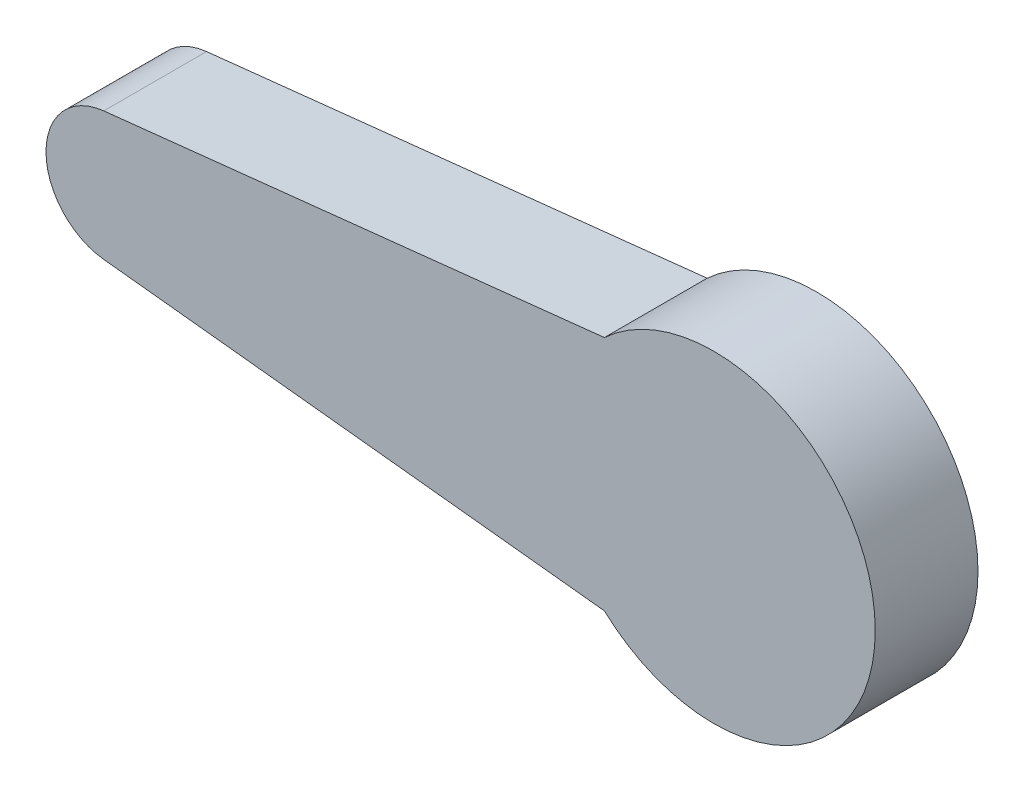
ISO-10303-21;
HEADER;
FILE_DESCRIPTION(('STEP AP214'),'2;1');
FILE_NAME('part.step','',(''),(''),'','','');
FILE_SCHEMA(('AUTOMOTIVE_DESIGN { 1 0 10303 214 1 1 1 1 }'));
ENDSEC;
DATA;
#1=APPLICATION_CONTEXT('core data for automotive mechanical design processes');
#2=APPLICATION_PROTOCOL_DEFINITION('international standard','automotive_design',2000,#1);
#3=PRODUCT_CONTEXT('',#1,'mechanical');
#4=PRODUCT('Part','Part','',(#3));
#5=PRODUCT_RELATED_PRODUCT_CATEGORY('part','',(#4));
#6=PRODUCT_DEFINITION_FORMATION('','',#4);
#7=PRODUCT_DEFINITION_CONTEXT('part definition',#1,'design');
#8=PRODUCT_DEFINITION('design','',#6,#7);
#9=PRODUCT_DEFINITION_SHAPE('','',#8);
#10=(LENGTH_UNIT() NAMED_UNIT(*) SI_UNIT(.MILLI.,.METRE.));
#11=(NAMED_UNIT(*) PLANE_ANGLE_UNIT() SI_UNIT($,.RADIAN.));
#12=(NAMED_UNIT(*) SI_UNIT($,.STERADIAN.) SOLID_ANGLE_UNIT());
#13=UNCERTAINTY_MEASURE_WITH_UNIT(LENGTH_MEASURE(1.E-05),#10,'distance_accuracy_value','');
#14=(GEOMETRIC_REPRESENTATION_CONTEXT(3) GLOBAL_UNCERTAINTY_ASSIGNED_CONTEXT((#13)) GLOBAL_UNIT_ASSIGNED_CONTEXT((#10,
#11,#12)) REPRESENTATION_CONTEXT('',''));
#15=CARTESIAN_POINT('',(0.,0.,0.));
#16=DIRECTION('',(0.,0.,1.));
#17=DIRECTION('',(1.,0.,0.));
#18=AXIS2_PLACEMENT_3D('',#15,#16,#17);
#19=CARTESIAN_POINT('',(-11.2799246231682,0.,0.));
#20=DIRECTION('',(0.,0.,1.));
#21=DIRECTION('',(1.,0.,0.));
#22=AXIS2_PLACEMENT_3D('',#19,#20,#21);
#23=PLANE('',#22);
#24=DIRECTION('',(-0.994225438983225,-0.10731158594771,0.));
#25=VECTOR('',#24,1.);
#26=CARTESIAN_POINT('',(7.93694518506527,4.60750982165337,0.));
#27=LINE('',#26,#25);
#28=CARTESIAN_POINT('',(7.93694518506527,4.60750982165337,0.));
#29=VERTEX_POINT('',#28);
#30=CARTESIAN_POINT('',(-11.5502114628193,2.50416625036577,0.));
#31=VERTEX_POINT('',#30);
#32=EDGE_CURVE('E133',#29,#31,#27,.T.);
#33=ORIENTED_EDGE('',*,*,#32,.F.);
#34=CARTESIAN_POINT('',(12.2013646778512,0.,0.));
#35=DIRECTION('',(0.,0.,-1.));
#36=DIRECTION('',(-1.,0.,0.));
#37=AXIS2_PLACEMENT_3D('',#34,#35,#36);
#38=CIRCLE('',#37,6.2780905032569);
#39=CARTESIAN_POINT('',(7.93694518506527,-4.60750982165337,0.));
#40=VERTEX_POINT('',#39);
#41=EDGE_CURVE('E144',#29,#40,#38,.T.);
#42=ORIENTED_EDGE('',*,*,#41,.T.);
#43=DIRECTION('',(0.994225438983225,-0.10731158594771,0.));
#44=VECTOR('',#43,1.);
#45=CARTESIAN_POINT('',(-11.5502114628193,-2.50416625036577,0.));
#46=LINE('',#45,#44);
#47=CARTESIAN_POINT('',(-11.5502114628193,-2.50416625036577,0.));
#48=VERTEX_POINT('',#47);
#49=EDGE_CURVE('E151',#48,#40,#46,.T.);
#50=ORIENTED_EDGE('',*,*,#49,.F.);
#51=CARTESIAN_POINT('',(-11.2799246231682,0.,0.));
#52=DIRECTION('',(0.,0.,1.));
#53=DIRECTION('',(1.,0.,0.));
#54=AXIS2_PLACEMENT_3D('',#51,#52,#53);
#55=CIRCLE('',#54,2.51871069898064);
#56=EDGE_CURVE('E136',#31,#48,#55,.T.);
#57=ORIENTED_EDGE('',*,*,#56,.F.);
#58=EDGE_LOOP('',(#33,#42,#50,#57));
#59=FACE_BOUND('',#58,.T.);
#60=CARTESIAN_POINT('',(-2.30825995095074,2.49806605279446,0.));
#61=CARTESIAN_POINT('',(-2.73027096534099,2.49868152297986,0.));
#62=CARTESIAN_POINT('',(-3.36525519111259,2.31776714159565,0.));
#63=CARTESIAN_POINT('',(-4.0519471173828,1.79121945249872,0.));
#64=CARTESIAN_POINT('',(-4.45450445000801,1.26652861552728,0.));
#65=CARTESIAN_POINT('',(-4.70755649296628,0.655614107295277,0.));
#66=CARTESIAN_POINT('',(-4.79387213088173,0.,0.));
#67=CARTESIAN_POINT('',(-4.70755649296628,-0.655614107295276,0.));
#68=CARTESIAN_POINT('',(-4.45450445000801,-1.26652861552729,0.));
#69=CARTESIAN_POINT('',(-4.0519471173828,-1.79121945249872,0.));
#70=CARTESIAN_POINT('',(-3.36525519111259,-2.31776714159565,0.));
#71=CARTESIAN_POINT('',(-2.73027096534099,-2.49868152297986,0.));
#72=CARTESIAN_POINT('',(-2.30825995095074,-2.49806605279446,0.));
#73=B_SPLINE_CURVE_WITH_KNOTS('',3,(#60,#61,#62,#63,#64,#65,#66,#67,#68,#69,#70,#71,#72),
.UNSPECIFIED.,.F.,.F.,(4,1,1,1,1,1,1,1,1,1,4),(0.,0.162547315698738,0.246910500112196,
0.331273484688599,0.415637005846892,0.5,0.584362994153108,0.668726515311401,0.753089499887804,
0.837452684301262,1.),.UNSPECIFIED.);
#74=CARTESIAN_POINT('',(-2.30825995095074,2.49806605279446,0.));
#75=VERTEX_POINT('',#74);
#76=CARTESIAN_POINT('',(-2.30825995095074,-2.49806605279446,0.));
#77=VERTEX_POINT('',#76);
#78=EDGE_CURVE('E55',#75,#77,#73,.T.);
#79=ORIENTED_EDGE('',*,*,#78,.T.);
#80=DIRECTION('',(0.998250566900798,-0.0591253387494285,0.));
#81=VECTOR('',#80,1.);
#82=CARTESIAN_POINT('',(9.37504414469004,-3.19005595520139,0.));
#83=LINE('',#82,#81);
#84=CARTESIAN_POINT('',(9.37504414469004,-3.19005595520139,0.));
#85=VERTEX_POINT('',#84);
#86=EDGE_CURVE('E132',#77,#85,#83,.T.);
#87=ORIENTED_EDGE('',*,*,#86,.T.);
#88=CARTESIAN_POINT('',(9.37504414469004,-3.19005595520139,0.));
#89=CARTESIAN_POINT('',(9.74360040876109,-3.53484293919703,0.));
#90=CARTESIAN_POINT('',(10.5428570191187,-3.88633535555283,0.));
#91=CARTESIAN_POINT('',(11.7382013204245,-4.05165126945385,0.));
#92=CARTESIAN_POINT('',(12.7877855246039,-3.91194774983133,0.));
#93=CARTESIAN_POINT('',(13.7642990955492,-3.50777948619926,0.));
#94=CARTESIAN_POINT('',(14.6032502640424,-2.86396771618949,0.));
#95=CARTESIAN_POINT('',(15.2468503589831,-2.02521728614815,0.));
#96=CARTESIAN_POINT('',(15.6516651084562,-1.04811231295659,0.));
#97=CARTESIAN_POINT('',(15.7889928154445,-0.000691817754812136,0.));
#98=CARTESIAN_POINT('',(15.6535287568039,1.05087958765089,0.));
#99=CARTESIAN_POINT('',(15.2393957517555,2.01553180953456,0.));
#100=CARTESIAN_POINT('',(14.749448402042,2.72799658708562,0.));
#101=CARTESIAN_POINT('',(14.1725249859326,3.12361030474993,0.));
#102=CARTESIAN_POINT('',(13.6476475877295,3.58835164958077,0.));
#103=CARTESIAN_POINT('',(12.7816062725977,3.90400354803467,0.));
#104=CARTESIAN_POINT('',(11.739855888239,4.05377842345117,0.));
#105=CARTESIAN_POINT('',(10.54211336446,3.88537929441961,0.));
#106=CARTESIAN_POINT('',(9.74376271711854,3.53505160690367,0.));
#107=CARTESIAN_POINT('',(9.37504414469004,3.19005595520139,0.));
#108=B_SPLINE_CURVE_WITH_KNOTS('',3,(#88,#89,#90,#91,#92,#93,#94,#95,#96,#97,#98,#99,#100,#101,
#102,#103,#104,#105,#106,#107),.UNSPECIFIED.,.F.,.F.,(4,1,1,1,1,1,1,1,1,1,1,1,1,1,1,1,1,4),(0.,
0.0851368769983083,0.144403022869954,0.2036691687416,0.262935433986645,0.32220149870547,
0.381467600441595,0.440733878928586,0.499999999999802,0.559266121071018,0.618532399558009,
0.677798501294134,0.702497282971547,0.737064566013355,0.7963308312584,0.855596977130046,
0.914863123001692,1.),.UNSPECIFIED.);
#109=CARTESIAN_POINT('',(9.37504414469004,3.19005595520139,0.));
#110=VERTEX_POINT('',#109);
#111=EDGE_CURVE('E304',#85,#110,#108,.T.);
#112=ORIENTED_EDGE('',*,*,#111,.T.);
#113=DIRECTION('',(-0.998250566900798,-0.0591253387494285,0.));
#114=VECTOR('',#113,1.);
#115=CARTESIAN_POINT('',(-2.30825995095074,2.49806605279446,0.));
#116=LINE('',#115,#114);
#117=EDGE_CURVE('E128',#110,#75,#116,.T.);
#118=ORIENTED_EDGE('',*,*,#117,.T.);
#119=EDGE_LOOP('',(#79,#87,#112,#118));
#120=FACE_BOUND('',#119,.T.);
#121=ADVANCED_FACE('F40',(#59,#120),#23,.F.);
#122=CARTESIAN_POINT('',(7.93694518506527,4.60750982165337,4.));
#123=DIRECTION('',(0.10731158594771,-0.994225438983225,0.));
#124=DIRECTION('',(0.994225438983225,0.10731158594771,0.));
#125=AXIS2_PLACEMENT_3D('',#122,#123,#124);
#126=PLANE('',#125);
#127=ORIENTED_EDGE('',*,*,#32,.T.);
#128=DIRECTION('',(0.,0.,-1.));
#129=VECTOR('',#128,1.);
#130=CARTESIAN_POINT('',(-11.5502114628193,2.50416625036577,4.));
#131=LINE('',#130,#129);
#132=CARTESIAN_POINT('',(-11.5502114628193,2.50416625036577,4.));
#133=VERTEX_POINT('',#132);
#134=EDGE_CURVE('E11',#133,#31,#131,.T.);
#135=ORIENTED_EDGE('',*,*,#134,.F.);
#136=DIRECTION('',(-0.994225438983225,-0.10731158594771,0.));
#137=VECTOR('',#136,1.);
#138=CARTESIAN_POINT('',(7.93694518506527,4.60750982165337,4.));
#139=LINE('',#138,#137);
#140=CARTESIAN_POINT('',(7.93694518506527,4.60750982165337,4.));
#141=VERTEX_POINT('',#140);
#142=EDGE_CURVE('E142',#141,#133,#139,.T.);
#143=ORIENTED_EDGE('',*,*,#142,.F.);
#144=DIRECTION('',(0.,0.,-1.));
#145=VECTOR('',#144,1.);
#146=CARTESIAN_POINT('',(7.93694518506527,4.60750982165337,4.));
#147=LINE('',#146,#145);
#148=EDGE_CURVE('E64',#141,#29,#147,.T.);
#149=ORIENTED_EDGE('',*,*,#148,.T.);
#150=EDGE_LOOP('',(#127,#135,#143,#149));
#151=FACE_BOUND('',#150,.T.);
#152=ADVANCED_FACE('F42',(#151),#126,.F.);
#153=CARTESIAN_POINT('',(-11.2799246231682,0.,4.));
#154=DIRECTION('',(0.,0.,-1.));
#155=DIRECTION('',(-1.,0.,0.));
#156=AXIS2_PLACEMENT_3D('',#153,#154,#155);
#157=CYLINDRICAL_SURFACE('',#156,2.51871069898064);
#158=ORIENTED_EDGE('',*,*,#56,.T.);
#159=DIRECTION('',(0.,0.,-1.));
#160=VECTOR('',#159,1.);
#161=CARTESIAN_POINT('',(-11.5502114628193,-2.50416625036577,4.));
#162=LINE('',#161,#160);
#163=CARTESIAN_POINT('',(-11.5502114628193,-2.50416625036577,4.));
#164=VERTEX_POINT('',#163);
#165=EDGE_CURVE('E48',#164,#48,#162,.T.);
#166=ORIENTED_EDGE('',*,*,#165,.F.);
#167=CARTESIAN_POINT('',(-11.2799246231682,0.,4.));
#168=DIRECTION('',(0.,0.,1.));
#169=DIRECTION('',(1.,0.,0.));
#170=AXIS2_PLACEMENT_3D('',#167,#168,#169);
#171=CIRCLE('',#170,2.51871069898064);
#172=EDGE_CURVE('E90',#133,#164,#171,.T.);
#173=ORIENTED_EDGE('',*,*,#172,.F.);
#174=ORIENTED_EDGE('',*,*,#134,.T.);
#175=EDGE_LOOP('',(#158,#166,#173,#174));
#176=FACE_BOUND('',#175,.T.);
#177=ADVANCED_FACE('F171',(#176),#157,.T.);
#178=CARTESIAN_POINT('',(-11.5502114628193,-2.50416625036577,4.));
#179=DIRECTION('',(0.10731158594771,0.994225438983225,0.));
#180=DIRECTION('',(-0.994225438983225,0.10731158594771,0.));
#181=AXIS2_PLACEMENT_3D('',#178,#179,#180);
#182=PLANE('',#181);
#183=ORIENTED_EDGE('',*,*,#49,.T.);
#184=DIRECTION('',(0.,0.,-1.));
#185=VECTOR('',#184,1.);
#186=CARTESIAN_POINT('',(7.93694518506527,-4.60750982165337,4.));
#187=LINE('',#186,#185);
#188=CARTESIAN_POINT('',(7.93694518506527,-4.60750982165337,4.));
#189=VERTEX_POINT('',#188);
#190=EDGE_CURVE('E157',#189,#40,#187,.T.);
#191=ORIENTED_EDGE('',*,*,#190,.F.);
#192=DIRECTION('',(0.994225438983225,-0.10731158594771,0.));
#193=VECTOR('',#192,1.);
#194=CARTESIAN_POINT('',(-11.5502114628193,-2.50416625036577,4.));
#195=LINE('',#194,#193);
#196=EDGE_CURVE('E146',#164,#189,#195,.T.);
#197=ORIENTED_EDGE('',*,*,#196,.F.);
#198=ORIENTED_EDGE('',*,*,#165,.T.);
#199=EDGE_LOOP('',(#183,#191,#197,#198));
#200=FACE_BOUND('',#199,.T.);
#201=ADVANCED_FACE('F162',(#200),#182,.F.);
#202=CARTESIAN_POINT('',(12.2013646778512,0.,4.));
#203=DIRECTION('',(0.,0.,-1.));
#204=DIRECTION('',(-1.,0.,0.));
#205=AXIS2_PLACEMENT_3D('',#202,#203,#204);
#206=CYLINDRICAL_SURFACE('',#205,6.2780905032569);
#207=ORIENTED_EDGE('',*,*,#41,.F.);
#208=ORIENTED_EDGE('',*,*,#148,.F.);
#209=CARTESIAN_POINT('',(12.2013646778512,0.,4.));
#210=DIRECTION('',(0.,0.,-1.));
#211=DIRECTION('',(-1.,0.,0.));
#212=AXIS2_PLACEMENT_3D('',#209,#210,#211);
#213=CIRCLE('',#212,6.2780905032569);
#214=EDGE_CURVE('E148',#141,#189,#213,.T.);
#215=ORIENTED_EDGE('',*,*,#214,.T.);
#216=ORIENTED_EDGE('',*,*,#190,.T.);
#217=EDGE_LOOP('',(#207,#208,#215,#216));
#218=FACE_BOUND('',#217,.T.);
#219=ADVANCED_FACE('F166',(#218),#206,.T.);
#220=CARTESIAN_POINT('',(-11.2799246231682,0.,4.));
#221=DIRECTION('',(0.,0.,1.));
#222=DIRECTION('',(1.,0.,0.));
#223=AXIS2_PLACEMENT_3D('',#220,#221,#222);
#224=PLANE('',#223);
#225=ORIENTED_EDGE('',*,*,#142,.T.);
#226=ORIENTED_EDGE('',*,*,#172,.T.);
#227=ORIENTED_EDGE('',*,*,#196,.T.);
#228=ORIENTED_EDGE('',*,*,#214,.F.);
#229=EDGE_LOOP('',(#225,#226,#227,#228));
#230=FACE_BOUND('',#229,.T.);
#231=ADVANCED_FACE('F169',(#230),#224,.T.);
#232=CARTESIAN_POINT('',(-2.30825995095074,2.49806605279446,2.));
#233=CARTESIAN_POINT('',(-2.73027096534099,2.49868152297986,2.));
#234=CARTESIAN_POINT('',(-3.36525519111259,2.31776714159565,2.));
#235=CARTESIAN_POINT('',(-4.0519471173828,1.79121945249872,2.));
#236=CARTESIAN_POINT('',(-4.45450445000801,1.26652861552728,2.));
#237=CARTESIAN_POINT('',(-4.70755649296628,0.655614107295277,2.));
#238=CARTESIAN_POINT('',(-4.79387213088173,0.,2.));
#239=CARTESIAN_POINT('',(-4.70755649296628,-0.655614107295276,2.));
#240=CARTESIAN_POINT('',(-4.45450445000801,-1.26652861552729,2.));
#241=CARTESIAN_POINT('',(-4.0519471173828,-1.79121945249872,2.));
#242=CARTESIAN_POINT('',(-3.36525519111259,-2.31776714159565,2.));
#243=CARTESIAN_POINT('',(-2.73027096534099,-2.49868152297986,2.));
#244=CARTESIAN_POINT('',(-2.30825995095074,-2.49806605279446,2.));
#245=B_SPLINE_CURVE_WITH_KNOTS('',3,(#232,#233,#234,#235,#236,#237,#238,#239,#240,#241,#242,
#243,#244),.UNSPECIFIED.,.F.,.F.,(4,1,1,1,1,1,1,1,1,1,4),(0.,0.162547315698738,
0.246910500112196,0.331273484688599,0.415637005846892,0.5,0.584362994153108,0.668726515311401,
0.753089499887804,0.837452684301262,1.),.UNSPECIFIED.);
#246=DIRECTION('',(0.,0.,-1.));
#247=VECTOR('',#246,1.);
#248=SURFACE_OF_LINEAR_EXTRUSION('',#245,#247);
#249=ORIENTED_EDGE('',*,*,#78,.F.);
#250=DIRECTION('',(0.,0.,-1.));
#251=VECTOR('',#250,1.);
#252=CARTESIAN_POINT('',(-2.30825995095074,2.49806605279446,2.));
#253=LINE('',#252,#251);
#254=CARTESIAN_POINT('',(-2.30825995095074,2.49806605279446,2.));
#255=VERTEX_POINT('',#254);
#256=EDGE_CURVE('E127',#255,#75,#253,.T.);
#257=ORIENTED_EDGE('',*,*,#256,.F.);
#258=CARTESIAN_POINT('',(-2.30825995095074,-2.49806605279446,2.));
#259=VERTEX_POINT('',#258);
#260=EDGE_CURVE('E119',#255,#259,#245,.T.);
#261=ORIENTED_EDGE('',*,*,#260,.T.);
#262=DIRECTION('',(0.,0.,-1.));
#263=VECTOR('',#262,1.);
#264=CARTESIAN_POINT('',(-2.30825995095074,-2.49806605279446,2.));
#265=LINE('',#264,#263);
#266=EDGE_CURVE('E126',#259,#77,#265,.T.);
#267=ORIENTED_EDGE('',*,*,#266,.T.);
#268=EDGE_LOOP('',(#249,#257,#261,#267));
#269=FACE_BOUND('',#268,.T.);
#270=ADVANCED_FACE('F125',(#269),#248,.T.);
#271=CARTESIAN_POINT('',(9.37504414469004,-3.19005595520139,2.));
#272=DIRECTION('',(0.0591253387494286,0.998250566900798,0.));
#273=DIRECTION('',(-0.998250566900798,0.0591253387494286,0.));
#274=AXIS2_PLACEMENT_3D('',#271,#272,#273);
#275=PLANE('',#274);
#276=ORIENTED_EDGE('',*,*,#86,.F.);
#277=ORIENTED_EDGE('',*,*,#266,.F.);
#278=DIRECTION('',(0.998250566900798,-0.0591253387494285,0.));
#279=VECTOR('',#278,1.);
#280=CARTESIAN_POINT('',(9.37504414469004,-3.19005595520139,2.));
#281=LINE('',#280,#279);
#282=CARTESIAN_POINT('',(9.37504414469004,-3.19005595520139,2.));
#283=VERTEX_POINT('',#282);
#284=EDGE_CURVE('E115',#259,#283,#281,.T.);
#285=ORIENTED_EDGE('',*,*,#284,.T.);
#286=DIRECTION('',(0.,0.,-1.));
#287=VECTOR('',#286,1.);
#288=CARTESIAN_POINT('',(9.37504414469004,-3.19005595520139,2.));
#289=LINE('',#288,#287);
#290=EDGE_CURVE('E134',#283,#85,#289,.T.);
#291=ORIENTED_EDGE('',*,*,#290,.T.);
#292=EDGE_LOOP('',(#276,#277,#285,#291));
#293=FACE_BOUND('',#292,.T.);
#294=ADVANCED_FACE('F130',(#293),#275,.T.);
#295=CARTESIAN_POINT('',(9.37504414469004,-3.19005595520139,2.));
#296=CARTESIAN_POINT('',(9.74360040876109,-3.53484293919703,2.));
#297=CARTESIAN_POINT('',(10.5428570191187,-3.88633535555283,2.));
#298=CARTESIAN_POINT('',(11.7382013204245,-4.05165126945385,2.));
#299=CARTESIAN_POINT('',(12.7877855246039,-3.91194774983133,2.));
#300=CARTESIAN_POINT('',(13.7642990955492,-3.50777948619926,2.));
#301=CARTESIAN_POINT('',(14.6032502640424,-2.86396771618949,2.));
#302=CARTESIAN_POINT('',(15.2468503589831,-2.02521728614815,2.));
#303=CARTESIAN_POINT('',(15.6516651084562,-1.04811231295659,2.));
#304=CARTESIAN_POINT('',(15.7889928154445,-0.000691817754812136,2.));
#305=CARTESIAN_POINT('',(15.6535287568039,1.05087958765089,2.));
#306=CARTESIAN_POINT('',(15.2393957517555,2.01553180953456,2.));
#307=CARTESIAN_POINT('',(14.749448402042,2.72799658708562,2.));
#308=CARTESIAN_POINT('',(14.1725249859326,3.12361030474993,2.));
#309=CARTESIAN_POINT('',(13.6476475877295,3.58835164958077,2.));
#310=CARTESIAN_POINT('',(12.7816062725977,3.90400354803467,2.));
#311=CARTESIAN_POINT('',(11.739855888239,4.05377842345117,2.));
#312=CARTESIAN_POINT('',(10.54211336446,3.88537929441961,2.));
#313=CARTESIAN_POINT('',(9.74376271711854,3.53505160690367,2.));
#314=CARTESIAN_POINT('',(9.37504414469004,3.19005595520139,2.));
#315=B_SPLINE_CURVE_WITH_KNOTS('',3,(#295,#296,#297,#298,#299,#300,#301,#302,#303,#304,#305,
#306,#307,#308,#309,#310,#311,#312,#313,#314),.UNSPECIFIED.,.F.,.F.,(4,1,1,1,1,1,1,1,1,1,1,1,1,
1,1,1,1,4),(0.,0.0851368769983083,0.144403022869954,0.2036691687416,0.262935433986645,
0.32220149870547,0.381467600441595,0.440733878928586,0.499999999999802,0.559266121071018,
0.618532399558009,0.677798501294134,0.702497282971547,0.737064566013355,0.7963308312584,
0.855596977130046,0.914863123001692,1.),.UNSPECIFIED.);
#316=DIRECTION('',(0.,0.,-1.));
#317=VECTOR('',#316,1.);
#318=SURFACE_OF_LINEAR_EXTRUSION('',#315,#317);
#319=ORIENTED_EDGE('',*,*,#111,.F.);
#320=ORIENTED_EDGE('',*,*,#290,.F.);
#321=CARTESIAN_POINT('',(9.37504414469004,3.19005595520139,2.));
#322=VERTEX_POINT('',#321);
#323=EDGE_CURVE('E120',#283,#322,#315,.T.);
#324=ORIENTED_EDGE('',*,*,#323,.T.);
#325=DIRECTION('',(0.,0.,-1.));
#326=VECTOR('',#325,1.);
#327=CARTESIAN_POINT('',(9.37504414469004,3.19005595520139,2.));
#328=LINE('',#327,#326);
#329=EDGE_CURVE('E138',#322,#110,#328,.T.);
#330=ORIENTED_EDGE('',*,*,#329,.T.);
#331=EDGE_LOOP('',(#319,#320,#324,#330));
#332=FACE_BOUND('',#331,.T.);
#333=ADVANCED_FACE('F195',(#332),#318,.T.);
#334=CARTESIAN_POINT('',(-2.30825995095074,2.49806605279446,2.));
#335=DIRECTION('',(0.0591253387494286,-0.998250566900798,0.));
#336=DIRECTION('',(0.998250566900798,0.0591253387494286,0.));
#337=AXIS2_PLACEMENT_3D('',#334,#335,#336);
#338=PLANE('',#337);
#339=ORIENTED_EDGE('',*,*,#117,.F.);
#340=ORIENTED_EDGE('',*,*,#329,.F.);
#341=DIRECTION('',(-0.998250566900798,-0.0591253387494285,0.));
#342=VECTOR('',#341,1.);
#343=CARTESIAN_POINT('',(-2.30825995095074,2.49806605279446,2.));
#344=LINE('',#343,#342);
#345=EDGE_CURVE('E209',#322,#255,#344,.T.);
#346=ORIENTED_EDGE('',*,*,#345,.T.);
#347=ORIENTED_EDGE('',*,*,#256,.T.);
#348=EDGE_LOOP('',(#339,#340,#346,#347));
#349=FACE_BOUND('',#348,.T.);
#350=ADVANCED_FACE('F216',(#349),#338,.T.);
#351=CARTESIAN_POINT('',(-4.76510031148791,0.,2.));
#352=DIRECTION('',(0.,0.,1.));
#353=DIRECTION('',(1.,0.,0.));
#354=AXIS2_PLACEMENT_3D('',#351,#352,#353);
#355=PLANE('',#354);
#356=ORIENTED_EDGE('',*,*,#260,.F.);
#357=ORIENTED_EDGE('',*,*,#345,.F.);
#358=ORIENTED_EDGE('',*,*,#323,.F.);
#359=ORIENTED_EDGE('',*,*,#284,.F.);
#360=EDGE_LOOP('',(#356,#357,#358,#359));
#361=FACE_BOUND('',#360,.T.);
#362=ADVANCED_FACE('F117',(#361),#355,.F.);
#363=CLOSED_SHELL('',(#121,#152,#177,#201,#219,#231,#270,#294,#333,#350,#362));
#364=MANIFOLD_SOLID_BREP('B2',#363);
#365=ADVANCED_BREP_SHAPE_REPRESENTATION('',(#18,#364),#14);
#366=SHAPE_DEFINITION_REPRESENTATION(#9,#365);
ENDSEC;
END-ISO-10303-21;
